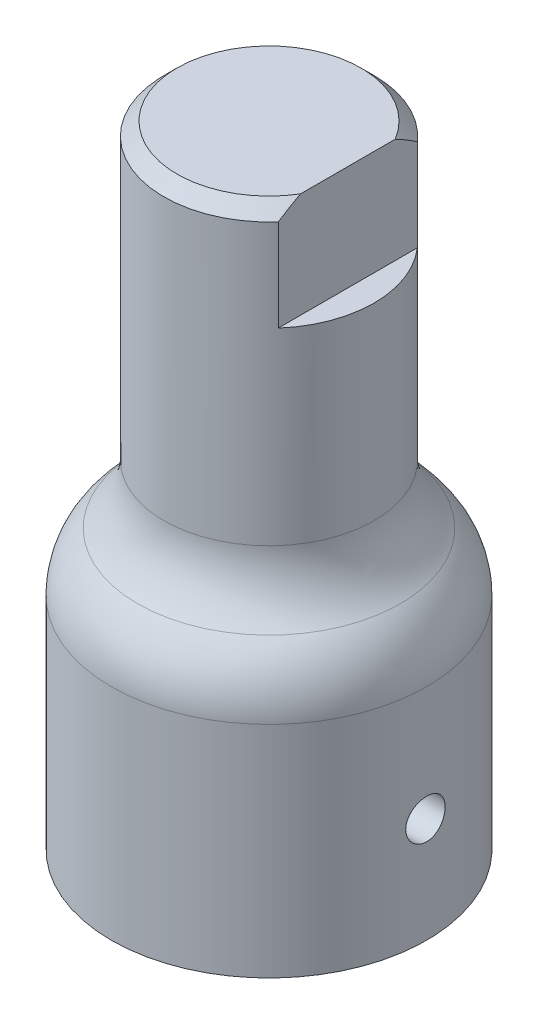
ISO-10303-21;
HEADER;
FILE_DESCRIPTION(('STEP AP214'),'2;1');
FILE_NAME('part.step','',(''),(''),'','','');
FILE_SCHEMA(('AUTOMOTIVE_DESIGN { 1 0 10303 214 1 1 1 1 }'));
ENDSEC;
DATA;
#1=APPLICATION_CONTEXT('core data for automotive mechanical design processes');
#2=APPLICATION_PROTOCOL_DEFINITION('international standard','automotive_design',2000,#1);
#3=PRODUCT_CONTEXT('',#1,'mechanical');
#4=PRODUCT('Part','Part','',(#3));
#5=PRODUCT_RELATED_PRODUCT_CATEGORY('part','',(#4));
#6=PRODUCT_DEFINITION_FORMATION('','',#4);
#7=PRODUCT_DEFINITION_CONTEXT('part definition',#1,'design');
#8=PRODUCT_DEFINITION('design','',#6,#7);
#9=PRODUCT_DEFINITION_SHAPE('','',#8);
#10=(LENGTH_UNIT() NAMED_UNIT(*) SI_UNIT(.MILLI.,.METRE.));
#11=(NAMED_UNIT(*) PLANE_ANGLE_UNIT() SI_UNIT($,.RADIAN.));
#12=(NAMED_UNIT(*) SI_UNIT($,.STERADIAN.) SOLID_ANGLE_UNIT());
#13=UNCERTAINTY_MEASURE_WITH_UNIT(LENGTH_MEASURE(1.E-05),#10,'distance_accuracy_value','');
#14=(GEOMETRIC_REPRESENTATION_CONTEXT(3) GLOBAL_UNCERTAINTY_ASSIGNED_CONTEXT((#13)) GLOBAL_UNIT_ASSIGNED_CONTEXT((#10,
#11,#12)) REPRESENTATION_CONTEXT('',''));
#15=CARTESIAN_POINT('',(0.,0.,0.));
#16=DIRECTION('',(0.,0.,1.));
#17=DIRECTION('',(1.,0.,0.));
#18=AXIS2_PLACEMENT_3D('',#15,#16,#17);
#19=CARTESIAN_POINT('',(0.,38.1,0.));
#20=DIRECTION('',(0.,-1.,0.));
#21=DIRECTION('',(0.,0.,-1.));
#22=AXIS2_PLACEMENT_3D('',#19,#20,#21);
#23=CYLINDRICAL_SURFACE('',#22,6.35);
#24=CARTESIAN_POINT('',(0.,20.3651280605346,0.));
#25=DIRECTION('',(0.,-1.,0.));
#26=DIRECTION('',(0.,0.,-1.));
#27=AXIS2_PLACEMENT_3D('',#24,#25,#26);
#28=CIRCLE('',#27,6.35);
#29=CARTESIAN_POINT('',(0.,20.3651280605346,-6.35));
#30=VERTEX_POINT('',#29);
#31=EDGE_CURVE('E150',#30,#30,#28,.F.);
#32=ORIENTED_EDGE('',*,*,#31,.T.);
#33=EDGE_LOOP('',(#32));
#34=FACE_BOUND('',#33,.T.);
#35=DIRECTION('',(0.,1.,0.));
#36=VECTOR('',#35,1.);
#37=CARTESIAN_POINT('',(4.7625,31.75,4.20013020631504));
#38=LINE('',#37,#36);
#39=CARTESIAN_POINT('',(4.7625,31.75,4.20013020631504));
#40=VERTEX_POINT('',#39);
#41=CARTESIAN_POINT('',(4.7625,37.30625,4.20013020631504));
#42=VERTEX_POINT('',#41);
#43=EDGE_CURVE('E83',#40,#42,#38,.T.);
#44=ORIENTED_EDGE('',*,*,#43,.T.);
#45=CARTESIAN_POINT('',(0.,37.30625,0.));
#46=DIRECTION('',(0.,1.,0.));
#47=DIRECTION('',(0.,0.,1.));
#48=AXIS2_PLACEMENT_3D('',#45,#46,#47);
#49=CIRCLE('',#48,6.35);
#50=CARTESIAN_POINT('',(4.7625,37.30625,-4.20013020631504));
#51=VERTEX_POINT('',#50);
#52=EDGE_CURVE('E11',#42,#51,#49,.F.);
#53=ORIENTED_EDGE('',*,*,#52,.T.);
#54=DIRECTION('',(0.,1.,0.));
#55=VECTOR('',#54,1.);
#56=CARTESIAN_POINT('',(4.7625,31.75,-4.20013020631504));
#57=LINE('',#56,#55);
#58=CARTESIAN_POINT('',(4.7625,31.75,-4.20013020631504));
#59=VERTEX_POINT('',#58);
#60=EDGE_CURVE('E81',#59,#51,#57,.T.);
#61=ORIENTED_EDGE('',*,*,#60,.F.);
#62=CARTESIAN_POINT('',(0.,31.75,0.));
#63=DIRECTION('',(0.,1.,0.));
#64=DIRECTION('',(0.,0.,1.));
#65=AXIS2_PLACEMENT_3D('',#62,#63,#64);
#66=CIRCLE('',#65,6.35);
#67=EDGE_CURVE('E86',#40,#59,#66,.T.);
#68=ORIENTED_EDGE('',*,*,#67,.F.);
#69=EDGE_LOOP('',(#44,#53,#61,#68));
#70=FACE_BOUND('',#69,.T.);
#71=ADVANCED_FACE('F36',(#34,#70),#23,.T.);
#72=CARTESIAN_POINT('',(0.,38.1,0.));
#73=DIRECTION('',(0.,1.,0.));
#74=DIRECTION('',(0.,0.,1.));
#75=AXIS2_PLACEMENT_3D('',#72,#73,#74);
#76=PLANE('',#75);
#77=DIRECTION('',(0.,0.,-1.));
#78=VECTOR('',#77,1.);
#79=CARTESIAN_POINT('',(4.7625,38.1,4.20013020631504));
#80=LINE('',#79,#78);
#81=CARTESIAN_POINT('',(4.7625,38.1,2.86190632489952));
#82=VERTEX_POINT('',#81);
#83=CARTESIAN_POINT('',(4.7625,38.1,-2.86190632489951));
#84=VERTEX_POINT('',#83);
#85=EDGE_CURVE('E89',#82,#84,#80,.T.);
#86=ORIENTED_EDGE('',*,*,#85,.T.);
#87=CARTESIAN_POINT('',(0.,38.1,0.));
#88=DIRECTION('',(0.,1.,0.));
#89=DIRECTION('',(0.,0.,1.));
#90=AXIS2_PLACEMENT_3D('',#87,#88,#89);
#91=CIRCLE('',#90,5.55624999999999);
#92=EDGE_CURVE('E166',#84,#82,#91,.T.);
#93=ORIENTED_EDGE('',*,*,#92,.T.);
#94=EDGE_LOOP('',(#86,#93));
#95=FACE_BOUND('',#94,.T.);
#96=ADVANCED_FACE('F142',(#95),#76,.T.);
#97=CARTESIAN_POINT('',(0.,0.,0.));
#98=DIRECTION('',(0.,1.,0.));
#99=DIRECTION('',(0.,0.,1.));
#100=AXIS2_PLACEMENT_3D('',#97,#98,#99);
#101=PLANE('',#100);
#102=CARTESIAN_POINT('',(0.,0.,0.));
#103=DIRECTION('',(0.,1.,0.));
#104=DIRECTION('',(0.,0.,1.));
#105=AXIS2_PLACEMENT_3D('',#102,#103,#104);
#106=CIRCLE('',#105,9.525);
#107=CARTESIAN_POINT('',(0.,0.,9.525));
#108=VERTEX_POINT('',#107);
#109=EDGE_CURVE('E153',#108,#108,#106,.T.);
#110=ORIENTED_EDGE('',*,*,#109,.F.);
#111=EDGE_LOOP('',(#110));
#112=FACE_BOUND('',#111,.T.);
#113=CARTESIAN_POINT('',(0.,0.,0.));
#114=DIRECTION('',(0.,1.,0.));
#115=DIRECTION('',(0.,0.,1.));
#116=AXIS2_PLACEMENT_3D('',#113,#114,#115);
#117=CIRCLE('',#116,6.35);
#118=CARTESIAN_POINT('',(4.7625,0.,-4.20013020631504));
#119=VERTEX_POINT('',#118);
#120=CARTESIAN_POINT('',(4.7625,0.,4.20013020631504));
#121=VERTEX_POINT('',#120);
#122=EDGE_CURVE('E104',#119,#121,#117,.T.);
#123=ORIENTED_EDGE('',*,*,#122,.T.);
#124=DIRECTION('',(0.,0.,-1.));
#125=VECTOR('',#124,1.);
#126=CARTESIAN_POINT('',(4.7625,0.,4.20013020631504));
#127=LINE('',#126,#125);
#128=EDGE_CURVE('E282',#121,#119,#127,.T.);
#129=ORIENTED_EDGE('',*,*,#128,.T.);
#130=EDGE_LOOP('',(#123,#129));
#131=FACE_BOUND('',#130,.T.);
#132=ADVANCED_FACE('F139',(#112,#131),#101,.F.);
#133=CARTESIAN_POINT('',(0.,15.875,0.));
#134=DIRECTION('',(0.,-1.,0.));
#135=DIRECTION('',(0.,0.,-1.));
#136=AXIS2_PLACEMENT_3D('',#133,#134,#135);
#137=CYLINDRICAL_SURFACE('',#136,9.525);
#138=CARTESIAN_POINT('',(9.525,5.159375,0.));
#139=CARTESIAN_POINT('',(9.52499907081924,5.15937782937064,0.0665993217584333));
#140=CARTESIAN_POINT('',(9.52429412394272,5.16498183370437,0.133240259761685));
#141=CARTESIAN_POINT('',(9.52154975978035,5.18724884311434,0.264667746995247));
#142=CARTESIAN_POINT('',(9.51950894913981,5.20392339543601,0.32945228620956));
#143=CARTESIAN_POINT('',(9.51432276572398,5.24783255291408,0.455245267504719));
#144=CARTESIAN_POINT('',(9.51117813655702,5.27506005016194,0.5162562192696));
#145=CARTESIAN_POINT('',(9.50413406293194,5.33928666899061,0.63283122491781));
#146=CARTESIAN_POINT('',(9.5002347479881,5.37628411431275,0.688396210941223));
#147=CARTESIAN_POINT('',(9.49209265522137,5.45921816611111,0.792819479063541));
#148=CARTESIAN_POINT('',(9.48784828372264,5.50519780785115,0.841643461301308));
#149=CARTESIAN_POINT('',(9.47950729512144,5.60469866970933,0.930903392931758));
#150=CARTESIAN_POINT('',(9.47541068555933,5.65822027401493,0.971338914756812));
#151=CARTESIAN_POINT('',(9.46781335551327,5.77150863931565,1.04280183931148));
#152=CARTESIAN_POINT('',(9.4643146875598,5.83129581844673,1.07379711069194));
#153=CARTESIAN_POINT('',(9.45833037427971,5.95527783348993,1.1252944902189));
#154=CARTESIAN_POINT('',(9.45584469053881,6.01947250215377,1.14579699627856));
#155=CARTESIAN_POINT('',(9.45218299236221,6.1500912981482,1.1756226392368));
#156=CARTESIAN_POINT('',(9.45100019611749,6.21650200898162,1.18500368539097));
#157=CARTESIAN_POINT('',(9.45005743403004,6.34996488297846,1.19249930547663));
#158=CARTESIAN_POINT('',(9.45029741096968,6.41701702023828,1.1906143324774));
#159=CARTESIAN_POINT('',(9.45216687494844,6.54945579897723,1.17567895885832));
#160=CARTESIAN_POINT('',(9.45378842328606,6.61484976217788,1.16269234837146));
#161=CARTESIAN_POINT('',(9.45822593884571,6.74252287885554,1.12602186999045));
#162=CARTESIAN_POINT('',(9.46104193026776,6.80480196919506,1.10233778535935));
#163=CARTESIAN_POINT('',(9.4675600393054,6.92467563453408,1.04487609790793));
#164=CARTESIAN_POINT('',(9.4712645849195,6.98225678424358,1.01107077457826));
#165=CARTESIAN_POINT('',(9.47914051318822,7.09095293821431,0.934346049828859));
#166=CARTESIAN_POINT('',(9.48331191719172,7.14206764654496,0.891426231533472));
#167=CARTESIAN_POINT('',(9.49168683585315,7.23675021598171,0.79733732649649));
#168=CARTESIAN_POINT('',(9.49589037311756,7.28026345495355,0.746113256233808));
#169=CARTESIAN_POINT('',(9.50382893754725,7.35808260411455,0.637059226790508));
#170=CARTESIAN_POINT('',(9.50756396363217,7.39238849307254,0.579229252377819));
#171=CARTESIAN_POINT('',(9.51414698744098,7.45081916637094,0.458562870986859));
#172=CARTESIAN_POINT('',(9.51699468708732,7.47494053041093,0.395724790529589));
#173=CARTESIAN_POINT('',(9.52147949227754,7.51227407254045,0.266846656630292));
#174=CARTESIAN_POINT('',(9.52311665449633,7.52548676135527,0.200806753245357));
#175=CARTESIAN_POINT('',(9.52498855290624,7.54055709830409,0.0678718943138049));
#176=CARTESIAN_POINT('',(9.5252325821293,7.54248999136339,0.000985594707088525));
#177=CARTESIAN_POINT('',(9.52431580975086,7.53514444165585,-0.132157487381931));
#178=CARTESIAN_POINT('',(9.52315503806674,7.52586623764643,-0.19841428324019));
#179=CARTESIAN_POINT('',(9.51956488620375,7.4964243761962,-0.328195546802373));
#180=CARTESIAN_POINT('',(9.51713968812605,7.47629659642949,-0.391728279164764));
#181=CARTESIAN_POINT('',(9.51129220626468,7.42576423852647,-0.514516523126314));
#182=CARTESIAN_POINT('',(9.50786988862572,7.39535931144346,-0.573771889410354));
#183=CARTESIAN_POINT('',(9.50038655660941,7.32495369326207,-0.686659402977385));
#184=CARTESIAN_POINT('',(9.49632233975245,7.28490432948007,-0.740260978173241));
#185=CARTESIAN_POINT('',(9.48801986532594,7.19641555179934,-0.840008316309531));
#186=CARTESIAN_POINT('',(9.4837816008531,7.14797580486547,-0.886153783157926));
#187=CARTESIAN_POINT('',(9.47558003976556,7.04374984276941,-0.969945970387078));
#188=CARTESIAN_POINT('',(9.47161844586032,6.98792337506967,-1.00754281309548));
#189=CARTESIAN_POINT('',(9.46444677006441,6.87070401088794,-1.07282593859747));
#190=CARTESIAN_POINT('',(9.46123667310901,6.80931122602431,-1.10051242006313));
#191=CARTESIAN_POINT('',(9.45594303749664,6.68286287925595,-1.14510815818519));
#192=CARTESIAN_POINT('',(9.45385656144256,6.61781736343965,-1.16204553632645));
#193=CARTESIAN_POINT('',(9.45103797450925,6.48577769209946,-1.18475283457956));
#194=CARTESIAN_POINT('',(9.4503058006243,6.41878362737453,-1.19052327420765));
#195=CARTESIAN_POINT('',(9.45028055162894,6.28524479746627,-1.1907233628104));
#196=CARTESIAN_POINT('',(9.45097753288118,6.21870013798194,-1.18523137240428));
#197=CARTESIAN_POINT('',(9.45371068298342,6.08748760464941,-1.16322843530949));
#198=CARTESIAN_POINT('',(9.45574685197692,6.02281973100231,-1.14671748744012));
#199=CARTESIAN_POINT('',(9.46092587637629,5.89720676184,-1.1031698188447));
#200=CARTESIAN_POINT('',(9.46406833493563,5.83626034055836,-1.0761368721874));
#201=CARTESIAN_POINT('',(9.47110651770345,5.71975615600949,-1.01232028714908));
#202=CARTESIAN_POINT('',(9.47500225135022,5.66419846027431,-0.97553652659144));
#203=CARTESIAN_POINT('',(9.48314050513251,5.5596482539316,-0.892971765265353));
#204=CARTESIAN_POINT('',(9.48738516580021,5.51070202422019,-0.847132366775322));
#205=CARTESIAN_POINT('',(9.49572411046119,5.42116637451375,-0.74787929559369));
#206=CARTESIAN_POINT('',(9.49981835876249,5.38057892761873,-0.694463839578669));
#207=CARTESIAN_POINT('',(9.50741235699438,5.3087815986786,-0.581342001931816));
#208=CARTESIAN_POINT('',(9.51090978693541,5.27760796494048,-0.521612469407673));
#209=CARTESIAN_POINT('',(9.5168925537279,5.22577794556112,-0.397755857220983));
#210=CARTESIAN_POINT('',(9.5193789896976,5.20511013219916,-0.333633642264448));
#211=CARTESIAN_POINT('',(9.52246025556089,5.17982549019592,-0.224316498899722));
#212=CARTESIAN_POINT('',(9.5234080195771,5.17216757888104,-0.179810884749931));
#213=CARTESIAN_POINT('',(9.52467820420526,5.1619413942386,-0.0902098763549198));
#214=CARTESIAN_POINT('',(9.52500062942852,5.15937308337983,-0.0451144864612309));
#215=CARTESIAN_POINT('',(9.525,5.159375,0.));
#216=B_SPLINE_CURVE_WITH_KNOTS('',3,(#138,#139,#140,#141,#142,#143,#144,#145,#146,#147,#148,
#149,#150,#151,#152,#153,#154,#155,#156,#157,#158,#159,#160,#161,#162,#163,#164,#165,#166,#167,
#168,#169,#170,#171,#172,#173,#174,#175,#176,#177,#178,#179,#180,#181,#182,#183,#184,#185,#186,
#187,#188,#189,#190,#191,#192,#193,#194,#195,#196,#197,#198,#199,#200,#201,#202,#203,#204,#205,
#206,#207,#208,#209,#210,#211,#212,#213,#214,#215),.UNSPECIFIED.,.T.,.F.,(4,2,2,2,2,2,2,2,2,2,2,
2,2,2,2,2,2,2,2,2,2,2,2,2,2,2,2,2,2,2,2,2,2,2,2,2,2,2,4),(0.,0.199633176159688,
0.399474909524307,0.599182273271568,0.798855394877486,0.999509747873777,1.20017432589755,
1.40151445464362,1.60284694747854,1.8031264354261,2.00339786907571,2.20252621680356,
2.40165859916672,2.60134144268485,2.8010334211962,3.00210606462468,3.2031791717012,
3.40431975217177,3.60545091505425,3.80523883060402,4.00502249144043,4.2041495191673,
4.40328330866349,4.60344394394661,4.80361252592386,5.00492063930482,5.20622471685508,
5.4069999537629,5.60776584983809,5.80713961697555,6.00651340547635,6.20581574766465,
6.40512058720716,6.60575531950734,6.80643735771344,7.00788255696301,7.20910816248271,
7.34434099068108,7.47957282165583),.UNSPECIFIED.);
#217=CARTESIAN_POINT('',(9.525,5.159375,0.));
#218=VERTEX_POINT('',#217);
#219=EDGE_CURVE('E97',#218,#218,#216,.T.);
#220=ORIENTED_EDGE('',*,*,#219,.T.);
#221=EDGE_LOOP('',(#220));
#222=FACE_BOUND('',#221,.T.);
#223=CARTESIAN_POINT('',(0.,13.2656122319727,0.));
#224=DIRECTION('',(0.,-1.,0.));
#225=DIRECTION('',(0.,0.,-1.));
#226=AXIS2_PLACEMENT_3D('',#223,#224,#225);
#227=CIRCLE('',#226,9.525);
#228=CARTESIAN_POINT('',(0.,13.2656122319727,-9.525));
#229=VERTEX_POINT('',#228);
#230=EDGE_CURVE('E156',#229,#229,#227,.T.);
#231=ORIENTED_EDGE('',*,*,#230,.T.);
#232=EDGE_LOOP('',(#231));
#233=FACE_BOUND('',#232,.T.);
#234=ORIENTED_EDGE('',*,*,#109,.T.);
#235=EDGE_LOOP('',(#234));
#236=FACE_BOUND('',#235,.T.);
#237=ADVANCED_FACE('F106',(#222,#233,#236),#137,.T.);
#238=CARTESIAN_POINT('',(0.,12.7,0.));
#239=DIRECTION('',(0.,-1.,0.));
#240=DIRECTION('',(0.,0.,-1.));
#241=AXIS2_PLACEMENT_3D('',#238,#239,#240);
#242=CYLINDRICAL_SURFACE('',#241,6.35);
#243=ORIENTED_EDGE('',*,*,#122,.F.);
#244=DIRECTION('',(0.,-1.,0.));
#245=VECTOR('',#244,1.);
#246=CARTESIAN_POINT('',(4.7625,12.7,-4.20013020631504));
#247=LINE('',#246,#245);
#248=CARTESIAN_POINT('',(4.7625,12.7,-4.20013020631504));
#249=VERTEX_POINT('',#248);
#250=EDGE_CURVE('E292',#249,#119,#247,.T.);
#251=ORIENTED_EDGE('',*,*,#250,.F.);
#252=CARTESIAN_POINT('',(0.,12.7,0.));
#253=DIRECTION('',(0.,1.,0.));
#254=DIRECTION('',(0.,0.,1.));
#255=AXIS2_PLACEMENT_3D('',#252,#253,#254);
#256=CIRCLE('',#255,6.35);
#257=CARTESIAN_POINT('',(4.7625,12.7,4.20013020631504));
#258=VERTEX_POINT('',#257);
#259=EDGE_CURVE('E286',#249,#258,#256,.T.);
#260=ORIENTED_EDGE('',*,*,#259,.T.);
#261=DIRECTION('',(0.,-1.,0.));
#262=VECTOR('',#261,1.);
#263=CARTESIAN_POINT('',(4.7625,12.7,4.20013020631504));
#264=LINE('',#263,#262);
#265=EDGE_CURVE('E159',#258,#121,#264,.T.);
#266=ORIENTED_EDGE('',*,*,#265,.T.);
#267=EDGE_LOOP('',(#243,#251,#260,#266));
#268=FACE_BOUND('',#267,.T.);
#269=ADVANCED_FACE('F132',(#268),#242,.F.);
#270=CARTESIAN_POINT('',(4.7625,12.7,4.20013020631504));
#271=DIRECTION('',(-1.,0.,0.));
#272=DIRECTION('',(0.,0.,1.));
#273=AXIS2_PLACEMENT_3D('',#270,#271,#272);
#274=PLANE('',#273);
#275=CARTESIAN_POINT('',(4.7625,6.35,0.));
#276=DIRECTION('',(-1.,0.,0.));
#277=DIRECTION('',(0.,0.,1.));
#278=AXIS2_PLACEMENT_3D('',#275,#276,#277);
#279=CIRCLE('',#278,1.190625);
#280=CARTESIAN_POINT('',(4.7625,6.35,1.190625));
#281=VERTEX_POINT('',#280);
#282=EDGE_CURVE('E92',#281,#281,#279,.T.);
#283=ORIENTED_EDGE('',*,*,#282,.F.);
#284=EDGE_LOOP('',(#283));
#285=FACE_BOUND('',#284,.T.);
#286=ORIENTED_EDGE('',*,*,#128,.F.);
#287=ORIENTED_EDGE('',*,*,#265,.F.);
#288=DIRECTION('',(0.,0.,-1.));
#289=VECTOR('',#288,1.);
#290=CARTESIAN_POINT('',(4.7625,12.7,4.20013020631504));
#291=LINE('',#290,#289);
#292=EDGE_CURVE('E288',#258,#249,#291,.T.);
#293=ORIENTED_EDGE('',*,*,#292,.T.);
#294=ORIENTED_EDGE('',*,*,#250,.T.);
#295=EDGE_LOOP('',(#286,#287,#293,#294));
#296=FACE_BOUND('',#295,.T.);
#297=ADVANCED_FACE('F129',(#285,#296),#274,.T.);
#298=CARTESIAN_POINT('',(0.,12.7,0.));
#299=DIRECTION('',(0.,1.,0.));
#300=DIRECTION('',(0.,0.,1.));
#301=AXIS2_PLACEMENT_3D('',#298,#299,#300);
#302=PLANE('',#301);
#303=ORIENTED_EDGE('',*,*,#259,.F.);
#304=ORIENTED_EDGE('',*,*,#292,.F.);
#305=EDGE_LOOP('',(#303,#304));
#306=FACE_BOUND('',#305,.T.);
#307=ADVANCED_FACE('F125',(#306),#302,.F.);
#308=CARTESIAN_POINT('',(0.,20.3651280605346,0.));
#309=DIRECTION('',(0.,-1.,0.));
#310=DIRECTION('',(0.,0.,-1.));
#311=AXIS2_PLACEMENT_3D('',#308,#309,#310);
#312=TOROIDAL_SURFACE('',#311,11.1125,4.7625);
#313=CARTESIAN_POINT('',(0.,16.8153701462537,0.));
#314=DIRECTION('',(0.,1.,0.));
#315=DIRECTION('',(0.,0.,1.));
#316=AXIS2_PLACEMENT_3D('',#313,#314,#315);
#317=CIRCLE('',#316,7.93749999999999);
#318=CARTESIAN_POINT('',(0.,16.8153701462537,7.93749999999999));
#319=VERTEX_POINT('',#318);
#320=EDGE_CURVE('E152',#319,#319,#317,.T.);
#321=ORIENTED_EDGE('',*,*,#320,.T.);
#322=EDGE_LOOP('',(#321));
#323=FACE_BOUND('',#322,.T.);
#324=ORIENTED_EDGE('',*,*,#31,.F.);
#325=EDGE_LOOP('',(#324));
#326=FACE_BOUND('',#325,.T.);
#327=ADVANCED_FACE('F121',(#323,#326),#312,.F.);
#328=CARTESIAN_POINT('',(0.,13.2656122319727,0.));
#329=DIRECTION('',(0.,-1.,0.));
#330=DIRECTION('',(0.,0.,-1.));
#331=AXIS2_PLACEMENT_3D('',#328,#329,#330);
#332=DEGENERATE_TOROIDAL_SURFACE('',#331,4.7625,4.7625,.T.);
#333=ORIENTED_EDGE('',*,*,#230,.F.);
#334=EDGE_LOOP('',(#333));
#335=FACE_BOUND('',#334,.T.);
#336=ORIENTED_EDGE('',*,*,#320,.F.);
#337=EDGE_LOOP('',(#336));
#338=FACE_BOUND('',#337,.T.);
#339=ADVANCED_FACE('F115',(#335,#338),#332,.T.);
#340=CARTESIAN_POINT('',(9.525,6.35,0.));
#341=DIRECTION('',(-1.,0.,0.));
#342=DIRECTION('',(0.,0.,1.));
#343=AXIS2_PLACEMENT_3D('',#340,#341,#342);
#344=CYLINDRICAL_SURFACE('',#343,1.190625);
#345=ORIENTED_EDGE('',*,*,#282,.T.);
#346=EDGE_LOOP('',(#345));
#347=FACE_BOUND('',#346,.T.);
#348=ORIENTED_EDGE('',*,*,#219,.F.);
#349=EDGE_LOOP('',(#348));
#350=FACE_BOUND('',#349,.T.);
#351=ADVANCED_FACE('F110',(#347,#350),#344,.F.);
#352=CARTESIAN_POINT('',(4.7625,31.75,4.20013020631504));
#353=DIRECTION('',(1.,0.,0.));
#354=DIRECTION('',(0.,0.,-1.));
#355=AXIS2_PLACEMENT_3D('',#352,#353,#354);
#356=PLANE('',#355);
#357=ORIENTED_EDGE('',*,*,#85,.F.);
#358=CARTESIAN_POINT('',(4.7625,38.1,2.86190632489952));
#359=CARTESIAN_POINT('',(4.7625,38.0405523803319,2.97728473468103));
#360=CARTESIAN_POINT('',(4.7625,37.9790569609474,3.09158529699657));
#361=CARTESIAN_POINT('',(4.7625,37.8525824129198,3.31813666600112));
#362=CARTESIAN_POINT('',(4.7625,37.7876058580941,3.43038890701487));
#363=CARTESIAN_POINT('',(4.7625,37.6547025930422,3.6531005161684));
#364=CARTESIAN_POINT('',(4.7625,37.5867763300089,3.76356015261344));
#365=CARTESIAN_POINT('',(4.7625,37.4483372325312,3.98296117478161));
#366=CARTESIAN_POINT('',(4.7625,37.3778225485784,4.09190139499944));
#367=CARTESIAN_POINT('',(4.7625,37.30625,4.20013020631504));
#368=B_SPLINE_CURVE_WITH_KNOTS('',3,(#358,#359,#360,#361,#362,#363,#364,#365,#366,#367),
.UNSPECIFIED.,.F.,.F.,(4,2,2,2,4),(0.,0.389329079905573,0.778374174152335,1.1673604914207,
1.55663037919007),.UNSPECIFIED.);
#369=EDGE_CURVE('E43',#82,#42,#368,.T.);
#370=ORIENTED_EDGE('',*,*,#369,.T.);
#371=ORIENTED_EDGE('',*,*,#43,.F.);
#372=DIRECTION('',(0.,0.,-1.));
#373=VECTOR('',#372,1.);
#374=CARTESIAN_POINT('',(4.7625,31.75,4.20013020631504));
#375=LINE('',#374,#373);
#376=EDGE_CURVE('E78',#40,#59,#375,.T.);
#377=ORIENTED_EDGE('',*,*,#376,.T.);
#378=ORIENTED_EDGE('',*,*,#60,.T.);
#379=CARTESIAN_POINT('',(4.7625,37.30625,-4.20013020631504));
#380=CARTESIAN_POINT('',(4.7625,37.3778225485784,-4.09190139499943));
#381=CARTESIAN_POINT('',(4.7625,37.4483372325312,-3.9829611747816));
#382=CARTESIAN_POINT('',(4.7625,37.5867763300089,-3.76356015261344));
#383=CARTESIAN_POINT('',(4.7625,37.6547025930422,-3.6531005161684));
#384=CARTESIAN_POINT('',(4.7625,37.7876058580941,-3.43038890701487));
#385=CARTESIAN_POINT('',(4.7625,37.8525824129198,-3.31813666600112));
#386=CARTESIAN_POINT('',(4.7625,37.9790569609474,-3.09158529699657));
#387=CARTESIAN_POINT('',(4.7625,38.0405523803319,-2.97728473468102));
#388=CARTESIAN_POINT('',(4.7625,38.1,-2.86190632489951));
#389=B_SPLINE_CURVE_WITH_KNOTS('',3,(#379,#380,#381,#382,#383,#384,#385,#386,#387,#388),
.UNSPECIFIED.,.F.,.F.,(4,2,2,2,4),(0.,0.389269887769375,0.778256205037737,1.16730129928449,
1.55663037919007),.UNSPECIFIED.);
#390=EDGE_CURVE('E169',#51,#84,#389,.T.);
#391=ORIENTED_EDGE('',*,*,#390,.T.);
#392=EDGE_LOOP('',(#357,#370,#371,#377,#378,#391));
#393=FACE_BOUND('',#392,.T.);
#394=ADVANCED_FACE('F80',(#393),#356,.T.);
#395=CARTESIAN_POINT('',(0.,31.75,0.));
#396=DIRECTION('',(0.,1.,0.));
#397=DIRECTION('',(0.,0.,1.));
#398=AXIS2_PLACEMENT_3D('',#395,#396,#397);
#399=PLANE('',#398);
#400=ORIENTED_EDGE('',*,*,#67,.T.);
#401=ORIENTED_EDGE('',*,*,#376,.F.);
#402=EDGE_LOOP('',(#400,#401));
#403=FACE_BOUND('',#402,.T.);
#404=ADVANCED_FACE('F88',(#403),#399,.T.);
#405=CARTESIAN_POINT('',(0.,38.1,0.));
#406=DIRECTION('',(0.,-1.,0.));
#407=DIRECTION('',(0.,0.,-1.));
#408=AXIS2_PLACEMENT_3D('',#405,#406,#407);
#409=CONICAL_SURFACE('',#408,5.55624999999999,0.785398163397455);
#410=ORIENTED_EDGE('',*,*,#390,.F.);
#411=ORIENTED_EDGE('',*,*,#52,.F.);
#412=ORIENTED_EDGE('',*,*,#369,.F.);
#413=ORIENTED_EDGE('',*,*,#92,.F.);
#414=EDGE_LOOP('',(#410,#411,#412,#413));
#415=FACE_BOUND('',#414,.T.);
#416=ADVANCED_FACE('F177',(#415),#409,.T.);
#417=CLOSED_SHELL('',(#71,#96,#132,#237,#269,#297,#307,#327,#339,#351,#394,#404,#416));
#418=MANIFOLD_SOLID_BREP('B2',#417);
#419=ADVANCED_BREP_SHAPE_REPRESENTATION('',(#18,#418),#14);
#420=SHAPE_DEFINITION_REPRESENTATION(#9,#419);
ENDSEC;
END-ISO-10303-21;
